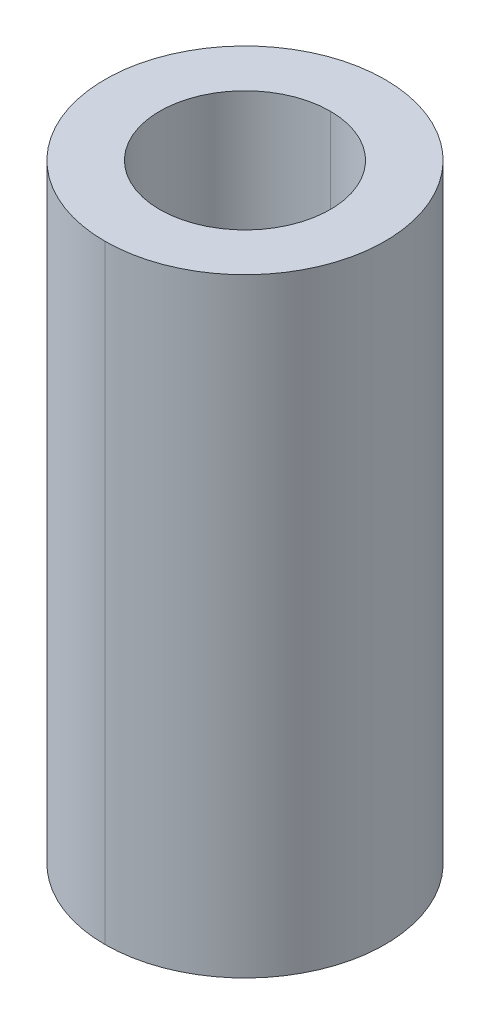
ISO-10303-21;
HEADER;
FILE_DESCRIPTION(('STEP AP214'),'2;1');
FILE_NAME('part.step','',(''),(''),'','','');
FILE_SCHEMA(('AUTOMOTIVE_DESIGN { 1 0 10303 214 1 1 1 1 }'));
ENDSEC;
DATA;
#1=APPLICATION_CONTEXT('core data for automotive mechanical design processes');
#2=APPLICATION_PROTOCOL_DEFINITION('international standard','automotive_design',2000,#1);
#3=PRODUCT_CONTEXT('',#1,'mechanical');
#4=PRODUCT('Part','Part','',(#3));
#5=PRODUCT_RELATED_PRODUCT_CATEGORY('part','',(#4));
#6=PRODUCT_DEFINITION_FORMATION('','',#4);
#7=PRODUCT_DEFINITION_CONTEXT('part definition',#1,'design');
#8=PRODUCT_DEFINITION('design','',#6,#7);
#9=PRODUCT_DEFINITION_SHAPE('','',#8);
#10=(LENGTH_UNIT() NAMED_UNIT(*) SI_UNIT(.MILLI.,.METRE.));
#11=(NAMED_UNIT(*) PLANE_ANGLE_UNIT() SI_UNIT($,.RADIAN.));
#12=(NAMED_UNIT(*) SI_UNIT($,.STERADIAN.) SOLID_ANGLE_UNIT());
#13=UNCERTAINTY_MEASURE_WITH_UNIT(LENGTH_MEASURE(1.E-05),#10,'distance_accuracy_value','');
#14=(GEOMETRIC_REPRESENTATION_CONTEXT(3) GLOBAL_UNCERTAINTY_ASSIGNED_CONTEXT((#13)) GLOBAL_UNIT_ASSIGNED_CONTEXT((#10,
#11,#12)) REPRESENTATION_CONTEXT('',''));
#15=CARTESIAN_POINT('',(0.,0.,0.));
#16=DIRECTION('',(0.,0.,1.));
#17=DIRECTION('',(1.,0.,0.));
#18=AXIS2_PLACEMENT_3D('',#15,#16,#17);
#19=CARTESIAN_POINT('',(0.,15.,0.));
#20=DIRECTION('',(0.,-1.,0.));
#21=DIRECTION('',(0.,0.,-1.));
#22=AXIS2_PLACEMENT_3D('',#19,#20,#21);
#23=CYLINDRICAL_SURFACE('',#22,2.1);
#24=DIRECTION('',(0.,-1.,0.));
#25=VECTOR('',#24,1.);
#26=CARTESIAN_POINT('',(0.,15.,2.1));
#27=LINE('',#26,#25);
#28=CARTESIAN_POINT('',(0.,15.,2.1));
#29=VERTEX_POINT('',#28);
#30=CARTESIAN_POINT('',(0.,0.,2.1));
#31=VERTEX_POINT('',#30);
#32=EDGE_CURVE('E77',#29,#31,#27,.T.);
#33=ORIENTED_EDGE('',*,*,#32,.F.);
#34=CARTESIAN_POINT('',(0.,15.,0.));
#35=DIRECTION('',(0.,1.,0.));
#36=DIRECTION('',(0.,0.,1.));
#37=AXIS2_PLACEMENT_3D('',#34,#35,#36);
#38=CIRCLE('',#37,2.1);
#39=CARTESIAN_POINT('',(0.,15.,-2.1));
#40=VERTEX_POINT('',#39);
#41=EDGE_CURVE('E72',#29,#40,#38,.T.);
#42=ORIENTED_EDGE('',*,*,#41,.T.);
#43=DIRECTION('',(0.,-1.,0.));
#44=VECTOR('',#43,1.);
#45=CARTESIAN_POINT('',(0.,15.,-2.1));
#46=LINE('',#45,#44);
#47=CARTESIAN_POINT('',(0.,0.,-2.1));
#48=VERTEX_POINT('',#47);
#49=EDGE_CURVE('E74',#40,#48,#46,.T.);
#50=ORIENTED_EDGE('',*,*,#49,.T.);
#51=CARTESIAN_POINT('',(0.,0.,0.));
#52=DIRECTION('',(0.,1.,0.));
#53=DIRECTION('',(0.,0.,1.));
#54=AXIS2_PLACEMENT_3D('',#51,#52,#53);
#55=CIRCLE('',#54,2.1);
#56=EDGE_CURVE('E11',#31,#48,#55,.T.);
#57=ORIENTED_EDGE('',*,*,#56,.F.);
#58=EDGE_LOOP('',(#33,#42,#50,#57));
#59=FACE_BOUND('',#58,.T.);
#60=ADVANCED_FACE('F17',(#59),#23,.F.);
#61=CARTESIAN_POINT('',(0.,15.,0.));
#62=DIRECTION('',(0.,-1.,0.));
#63=DIRECTION('',(0.,0.,-1.));
#64=AXIS2_PLACEMENT_3D('',#61,#62,#63);
#65=CYLINDRICAL_SURFACE('',#64,3.45);
#66=DIRECTION('',(0.,-1.,0.));
#67=VECTOR('',#66,1.);
#68=CARTESIAN_POINT('',(0.,15.,3.45));
#69=LINE('',#68,#67);
#70=CARTESIAN_POINT('',(0.,15.,3.45));
#71=VERTEX_POINT('',#70);
#72=CARTESIAN_POINT('',(0.,0.,3.45));
#73=VERTEX_POINT('',#72);
#74=EDGE_CURVE('E111',#71,#73,#69,.T.);
#75=ORIENTED_EDGE('',*,*,#74,.F.);
#76=CARTESIAN_POINT('',(0.,15.,0.));
#77=DIRECTION('',(0.,1.,0.));
#78=DIRECTION('',(0.,0.,1.));
#79=AXIS2_PLACEMENT_3D('',#76,#77,#78);
#80=CIRCLE('',#79,3.45);
#81=CARTESIAN_POINT('',(0.,15.,-3.45));
#82=VERTEX_POINT('',#81);
#83=EDGE_CURVE('E82',#82,#71,#80,.T.);
#84=ORIENTED_EDGE('',*,*,#83,.F.);
#85=DIRECTION('',(0.,-1.,0.));
#86=VECTOR('',#85,1.);
#87=CARTESIAN_POINT('',(0.,15.,-3.45));
#88=LINE('',#87,#86);
#89=CARTESIAN_POINT('',(0.,0.,-3.45));
#90=VERTEX_POINT('',#89);
#91=EDGE_CURVE('E102',#82,#90,#88,.T.);
#92=ORIENTED_EDGE('',*,*,#91,.T.);
#93=CARTESIAN_POINT('',(0.,0.,0.));
#94=DIRECTION('',(0.,1.,0.));
#95=DIRECTION('',(0.,0.,1.));
#96=AXIS2_PLACEMENT_3D('',#93,#94,#95);
#97=CIRCLE('',#96,3.45);
#98=EDGE_CURVE('E21',#90,#73,#97,.T.);
#99=ORIENTED_EDGE('',*,*,#98,.T.);
#100=EDGE_LOOP('',(#75,#84,#92,#99));
#101=FACE_BOUND('',#100,.T.);
#102=ADVANCED_FACE('F19',(#101),#65,.T.);
#103=CARTESIAN_POINT('',(0.,0.,0.));
#104=DIRECTION('',(0.,1.,0.));
#105=DIRECTION('',(1.,0.,0.));
#106=AXIS2_PLACEMENT_3D('',#103,#104,#105);
#107=PLANE('',#106);
#108=CARTESIAN_POINT('',(0.,0.,0.));
#109=DIRECTION('',(0.,1.,0.));
#110=DIRECTION('',(0.,0.,1.));
#111=AXIS2_PLACEMENT_3D('',#108,#109,#110);
#112=CIRCLE('',#111,2.1);
#113=EDGE_CURVE('E88',#48,#31,#112,.T.);
#114=ORIENTED_EDGE('',*,*,#113,.T.);
#115=ORIENTED_EDGE('',*,*,#56,.T.);
#116=EDGE_LOOP('',(#114,#115));
#117=FACE_BOUND('',#116,.T.);
#118=ORIENTED_EDGE('',*,*,#98,.F.);
#119=CARTESIAN_POINT('',(0.,0.,0.));
#120=DIRECTION('',(0.,1.,0.));
#121=DIRECTION('',(0.,0.,1.));
#122=AXIS2_PLACEMENT_3D('',#119,#120,#121);
#123=CIRCLE('',#122,3.45);
#124=EDGE_CURVE('E114',#73,#90,#123,.T.);
#125=ORIENTED_EDGE('',*,*,#124,.F.);
#126=EDGE_LOOP('',(#118,#125));
#127=FACE_BOUND('',#126,.T.);
#128=ADVANCED_FACE('F127',(#117,#127),#107,.F.);
#129=CARTESIAN_POINT('',(0.,15.,0.));
#130=DIRECTION('',(0.,1.,0.));
#131=DIRECTION('',(1.,0.,0.));
#132=AXIS2_PLACEMENT_3D('',#129,#130,#131);
#133=PLANE('',#132);
#134=CARTESIAN_POINT('',(0.,15.,0.));
#135=DIRECTION('',(0.,1.,0.));
#136=DIRECTION('',(0.,0.,1.));
#137=AXIS2_PLACEMENT_3D('',#134,#135,#136);
#138=CIRCLE('',#137,2.1);
#139=EDGE_CURVE('E86',#40,#29,#138,.T.);
#140=ORIENTED_EDGE('',*,*,#139,.F.);
#141=ORIENTED_EDGE('',*,*,#41,.F.);
#142=EDGE_LOOP('',(#140,#141));
#143=FACE_BOUND('',#142,.T.);
#144=ORIENTED_EDGE('',*,*,#83,.T.);
#145=CARTESIAN_POINT('',(0.,15.,0.));
#146=DIRECTION('',(0.,1.,0.));
#147=DIRECTION('',(0.,0.,1.));
#148=AXIS2_PLACEMENT_3D('',#145,#146,#147);
#149=CIRCLE('',#148,3.45);
#150=EDGE_CURVE('E90',#71,#82,#149,.T.);
#151=ORIENTED_EDGE('',*,*,#150,.T.);
#152=EDGE_LOOP('',(#144,#151));
#153=FACE_BOUND('',#152,.T.);
#154=ADVANCED_FACE('F92',(#143,#153),#133,.T.);
#155=CARTESIAN_POINT('',(0.,15.,0.));
#156=DIRECTION('',(0.,-1.,0.));
#157=DIRECTION('',(0.,0.,-1.));
#158=AXIS2_PLACEMENT_3D('',#155,#156,#157);
#159=CYLINDRICAL_SURFACE('',#158,3.45);
#160=ORIENTED_EDGE('',*,*,#150,.F.);
#161=ORIENTED_EDGE('',*,*,#74,.T.);
#162=ORIENTED_EDGE('',*,*,#124,.T.);
#163=ORIENTED_EDGE('',*,*,#91,.F.);
#164=EDGE_LOOP('',(#160,#161,#162,#163));
#165=FACE_BOUND('',#164,.T.);
#166=ADVANCED_FACE('F125',(#165),#159,.T.);
#167=CARTESIAN_POINT('',(0.,15.,0.));
#168=DIRECTION('',(0.,-1.,0.));
#169=DIRECTION('',(0.,0.,-1.));
#170=AXIS2_PLACEMENT_3D('',#167,#168,#169);
#171=CYLINDRICAL_SURFACE('',#170,2.1);
#172=ORIENTED_EDGE('',*,*,#139,.T.);
#173=ORIENTED_EDGE('',*,*,#32,.T.);
#174=ORIENTED_EDGE('',*,*,#113,.F.);
#175=ORIENTED_EDGE('',*,*,#49,.F.);
#176=EDGE_LOOP('',(#172,#173,#174,#175));
#177=FACE_BOUND('',#176,.T.);
#178=ADVANCED_FACE('F85',(#177),#171,.F.);
#179=CLOSED_SHELL('',(#60,#102,#128,#154,#166,#178));
#180=MANIFOLD_SOLID_BREP('B1',#179);
#181=ADVANCED_BREP_SHAPE_REPRESENTATION('',(#18,#180),#14);
#182=SHAPE_DEFINITION_REPRESENTATION(#9,#181);
ENDSEC;
END-ISO-10303-21;
